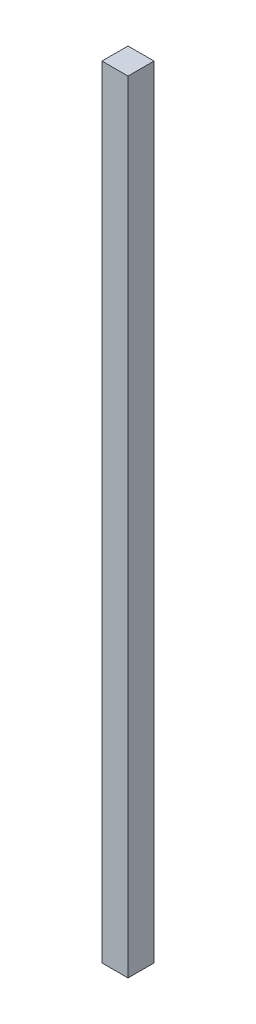
ISO-10303-21;
HEADER;
FILE_DESCRIPTION(('STEP AP214'),'2;1');
FILE_NAME('part.step','',(''),(''),'','','');
FILE_SCHEMA(('AUTOMOTIVE_DESIGN { 1 0 10303 214 1 1 1 1 }'));
ENDSEC;
DATA;
#1=APPLICATION_CONTEXT('core data for automotive mechanical design processes');
#2=APPLICATION_PROTOCOL_DEFINITION('international standard','automotive_design',2000,#1);
#3=PRODUCT_CONTEXT('',#1,'mechanical');
#4=PRODUCT('Part','Part','',(#3));
#5=PRODUCT_RELATED_PRODUCT_CATEGORY('part','',(#4));
#6=PRODUCT_DEFINITION_FORMATION('','',#4);
#7=PRODUCT_DEFINITION_CONTEXT('part definition',#1,'design');
#8=PRODUCT_DEFINITION('design','',#6,#7);
#9=PRODUCT_DEFINITION_SHAPE('','',#8);
#10=(LENGTH_UNIT() NAMED_UNIT(*) SI_UNIT(.MILLI.,.METRE.));
#11=(NAMED_UNIT(*) PLANE_ANGLE_UNIT() SI_UNIT($,.RADIAN.));
#12=(NAMED_UNIT(*) SI_UNIT($,.STERADIAN.) SOLID_ANGLE_UNIT());
#13=UNCERTAINTY_MEASURE_WITH_UNIT(LENGTH_MEASURE(1.E-05),#10,'distance_accuracy_value','');
#14=(GEOMETRIC_REPRESENTATION_CONTEXT(3) GLOBAL_UNCERTAINTY_ASSIGNED_CONTEXT((#13)) GLOBAL_UNIT_ASSIGNED_CONTEXT((#10,
#11,#12)) REPRESENTATION_CONTEXT('',''));
#15=CARTESIAN_POINT('',(0.,0.,0.));
#16=DIRECTION('',(0.,0.,1.));
#17=DIRECTION('',(1.,0.,0.));
#18=AXIS2_PLACEMENT_3D('',#15,#16,#17);
#19=CARTESIAN_POINT('',(-50.8,3048.,-50.8));
#20=DIRECTION('',(1.,0.,0.));
#21=DIRECTION('',(0.,0.,-1.));
#22=AXIS2_PLACEMENT_3D('',#19,#20,#21);
#23=PLANE('',#22);
#24=DIRECTION('',(0.,0.,1.));
#25=VECTOR('',#24,1.);
#26=CARTESIAN_POINT('',(-50.8,0.,-50.8));
#27=LINE('',#26,#25);
#28=CARTESIAN_POINT('',(-50.8,0.,-50.8));
#29=VERTEX_POINT('',#28);
#30=CARTESIAN_POINT('',(-50.8,0.,50.8));
#31=VERTEX_POINT('',#30);
#32=EDGE_CURVE('E108',#29,#31,#27,.T.);
#33=ORIENTED_EDGE('',*,*,#32,.T.);
#34=DIRECTION('',(0.,-1.,0.));
#35=VECTOR('',#34,1.);
#36=CARTESIAN_POINT('',(-50.8,3048.,50.8));
#37=LINE('',#36,#35);
#38=CARTESIAN_POINT('',(-50.8,3048.,50.8));
#39=VERTEX_POINT('',#38);
#40=EDGE_CURVE('E11',#39,#31,#37,.T.);
#41=ORIENTED_EDGE('',*,*,#40,.F.);
#42=DIRECTION('',(0.,0.,1.));
#43=VECTOR('',#42,1.);
#44=CARTESIAN_POINT('',(-50.8,3048.,-50.8));
#45=LINE('',#44,#43);
#46=CARTESIAN_POINT('',(-50.8,3048.,-50.8));
#47=VERTEX_POINT('',#46);
#48=EDGE_CURVE('E95',#47,#39,#45,.T.);
#49=ORIENTED_EDGE('',*,*,#48,.F.);
#50=DIRECTION('',(0.,-1.,0.));
#51=VECTOR('',#50,1.);
#52=CARTESIAN_POINT('',(-50.8,3048.,-50.8));
#53=LINE('',#52,#51);
#54=EDGE_CURVE('E104',#47,#29,#53,.T.);
#55=ORIENTED_EDGE('',*,*,#54,.T.);
#56=EDGE_LOOP('',(#33,#41,#49,#55));
#57=FACE_BOUND('',#56,.T.);
#58=ADVANCED_FACE('F39',(#57),#23,.F.);
#59=CARTESIAN_POINT('',(50.8,3048.,50.8));
#60=DIRECTION('',(0.,0.,-1.));
#61=DIRECTION('',(-1.,0.,0.));
#62=AXIS2_PLACEMENT_3D('',#59,#60,#61);
#63=PLANE('',#62);
#64=DIRECTION('',(1.,0.,0.));
#65=VECTOR('',#64,1.);
#66=CARTESIAN_POINT('',(50.8,0.,50.8));
#67=LINE('',#66,#65);
#68=CARTESIAN_POINT('',(50.8,0.,50.8));
#69=VERTEX_POINT('',#68);
#70=EDGE_CURVE('E99',#31,#69,#67,.T.);
#71=ORIENTED_EDGE('',*,*,#70,.T.);
#72=DIRECTION('',(0.,-1.,0.));
#73=VECTOR('',#72,1.);
#74=CARTESIAN_POINT('',(50.8,3048.,50.8));
#75=LINE('',#74,#73);
#76=CARTESIAN_POINT('',(50.8,3048.,50.8));
#77=VERTEX_POINT('',#76);
#78=EDGE_CURVE('E48',#77,#69,#75,.T.);
#79=ORIENTED_EDGE('',*,*,#78,.F.);
#80=DIRECTION('',(1.,0.,0.));
#81=VECTOR('',#80,1.);
#82=CARTESIAN_POINT('',(50.8,3048.,50.8));
#83=LINE('',#82,#81);
#84=EDGE_CURVE('E90',#39,#77,#83,.T.);
#85=ORIENTED_EDGE('',*,*,#84,.F.);
#86=ORIENTED_EDGE('',*,*,#40,.T.);
#87=EDGE_LOOP('',(#71,#79,#85,#86));
#88=FACE_BOUND('',#87,.T.);
#89=ADVANCED_FACE('F98',(#88),#63,.F.);
#90=CARTESIAN_POINT('',(50.8,3048.,-50.8));
#91=DIRECTION('',(-1.,0.,0.));
#92=DIRECTION('',(0.,0.,1.));
#93=AXIS2_PLACEMENT_3D('',#90,#91,#92);
#94=PLANE('',#93);
#95=DIRECTION('',(0.,0.,-1.));
#96=VECTOR('',#95,1.);
#97=CARTESIAN_POINT('',(50.8,0.,-50.8));
#98=LINE('',#97,#96);
#99=CARTESIAN_POINT('',(50.8,0.,-50.8));
#100=VERTEX_POINT('',#99);
#101=EDGE_CURVE('E76',#69,#100,#98,.T.);
#102=ORIENTED_EDGE('',*,*,#101,.T.);
#103=DIRECTION('',(0.,-1.,0.));
#104=VECTOR('',#103,1.);
#105=CARTESIAN_POINT('',(50.8,3048.,-50.8));
#106=LINE('',#105,#104);
#107=CARTESIAN_POINT('',(50.8,3048.,-50.8));
#108=VERTEX_POINT('',#107);
#109=EDGE_CURVE('E101',#108,#100,#106,.T.);
#110=ORIENTED_EDGE('',*,*,#109,.F.);
#111=DIRECTION('',(0.,0.,-1.));
#112=VECTOR('',#111,1.);
#113=CARTESIAN_POINT('',(50.8,3048.,-50.8));
#114=LINE('',#113,#112);
#115=EDGE_CURVE('E93',#77,#108,#114,.T.);
#116=ORIENTED_EDGE('',*,*,#115,.F.);
#117=ORIENTED_EDGE('',*,*,#78,.T.);
#118=EDGE_LOOP('',(#102,#110,#116,#117));
#119=FACE_BOUND('',#118,.T.);
#120=ADVANCED_FACE('F102',(#119),#94,.F.);
#121=CARTESIAN_POINT('',(50.8,3048.,-50.8));
#122=DIRECTION('',(0.,0.,1.));
#123=DIRECTION('',(1.,0.,0.));
#124=AXIS2_PLACEMENT_3D('',#121,#122,#123);
#125=PLANE('',#124);
#126=DIRECTION('',(-1.,0.,0.));
#127=VECTOR('',#126,1.);
#128=CARTESIAN_POINT('',(50.8,0.,-50.8));
#129=LINE('',#128,#127);
#130=EDGE_CURVE('E83',#100,#29,#129,.T.);
#131=ORIENTED_EDGE('',*,*,#130,.T.);
#132=ORIENTED_EDGE('',*,*,#54,.F.);
#133=DIRECTION('',(-1.,0.,0.));
#134=VECTOR('',#133,1.);
#135=CARTESIAN_POINT('',(50.8,3048.,-50.8));
#136=LINE('',#135,#134);
#137=EDGE_CURVE('E56',#108,#47,#136,.T.);
#138=ORIENTED_EDGE('',*,*,#137,.F.);
#139=ORIENTED_EDGE('',*,*,#109,.T.);
#140=EDGE_LOOP('',(#131,#132,#138,#139));
#141=FACE_BOUND('',#140,.T.);
#142=ADVANCED_FACE('F121',(#141),#125,.F.);
#143=CARTESIAN_POINT('',(0.,3048.,0.));
#144=DIRECTION('',(0.,-1.,0.));
#145=DIRECTION('',(0.,0.,-1.));
#146=AXIS2_PLACEMENT_3D('',#143,#144,#145);
#147=PLANE('',#146);
#148=ORIENTED_EDGE('',*,*,#48,.T.);
#149=ORIENTED_EDGE('',*,*,#84,.T.);
#150=ORIENTED_EDGE('',*,*,#115,.T.);
#151=ORIENTED_EDGE('',*,*,#137,.T.);
#152=EDGE_LOOP('',(#148,#149,#150,#151));
#153=FACE_BOUND('',#152,.T.);
#154=ADVANCED_FACE('F91',(#153),#147,.F.);
#155=CARTESIAN_POINT('',(0.,0.,0.));
#156=DIRECTION('',(0.,-1.,0.));
#157=DIRECTION('',(0.,0.,-1.));
#158=AXIS2_PLACEMENT_3D('',#155,#156,#157);
#159=PLANE('',#158);
#160=ORIENTED_EDGE('',*,*,#32,.F.);
#161=ORIENTED_EDGE('',*,*,#130,.F.);
#162=ORIENTED_EDGE('',*,*,#101,.F.);
#163=ORIENTED_EDGE('',*,*,#70,.F.);
#164=EDGE_LOOP('',(#160,#161,#162,#163));
#165=FACE_BOUND('',#164,.T.);
#166=ADVANCED_FACE('F124',(#165),#159,.T.);
#167=CLOSED_SHELL('',(#58,#89,#120,#142,#154,#166));
#168=MANIFOLD_SOLID_BREP('B2',#167);
#169=ADVANCED_BREP_SHAPE_REPRESENTATION('',(#18,#168),#14);
#170=SHAPE_DEFINITION_REPRESENTATION(#9,#169);
ENDSEC;
END-ISO-10303-21;
